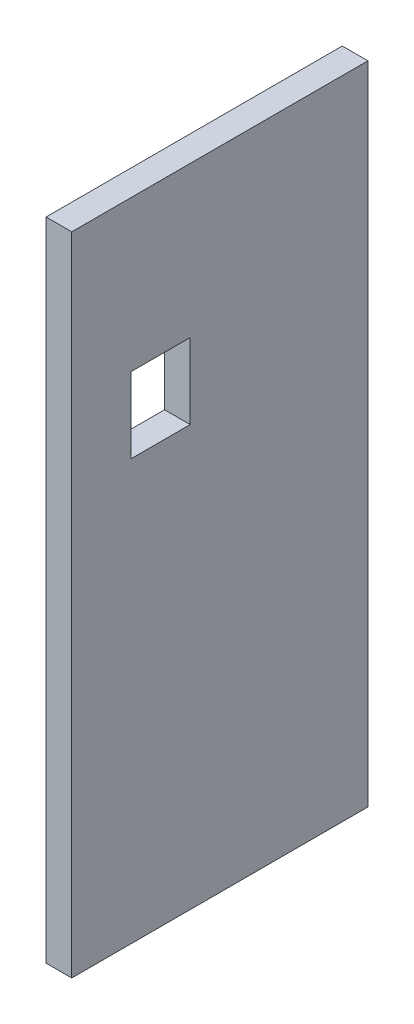
ISO-10303-21;
HEADER;
FILE_DESCRIPTION(('STEP AP214'),'2;1');
FILE_NAME('part.step','',(''),(''),'','','');
FILE_SCHEMA(('AUTOMOTIVE_DESIGN { 1 0 10303 214 1 1 1 1 }'));
ENDSEC;
DATA;
#1=APPLICATION_CONTEXT('core data for automotive mechanical design processes');
#2=APPLICATION_PROTOCOL_DEFINITION('international standard','automotive_design',2000,#1);
#3=PRODUCT_CONTEXT('',#1,'mechanical');
#4=PRODUCT('Part','Part','',(#3));
#5=PRODUCT_RELATED_PRODUCT_CATEGORY('part','',(#4));
#6=PRODUCT_DEFINITION_FORMATION('','',#4);
#7=PRODUCT_DEFINITION_CONTEXT('part definition',#1,'design');
#8=PRODUCT_DEFINITION('design','',#6,#7);
#9=PRODUCT_DEFINITION_SHAPE('','',#8);
#10=(LENGTH_UNIT() NAMED_UNIT(*) SI_UNIT(.MILLI.,.METRE.));
#11=(NAMED_UNIT(*) PLANE_ANGLE_UNIT() SI_UNIT($,.RADIAN.));
#12=(NAMED_UNIT(*) SI_UNIT($,.STERADIAN.) SOLID_ANGLE_UNIT());
#13=UNCERTAINTY_MEASURE_WITH_UNIT(LENGTH_MEASURE(1.E-05),#10,'distance_accuracy_value','');
#14=(GEOMETRIC_REPRESENTATION_CONTEXT(3) GLOBAL_UNCERTAINTY_ASSIGNED_CONTEXT((#13)) GLOBAL_UNIT_ASSIGNED_CONTEXT((#10,
#11,#12)) REPRESENTATION_CONTEXT('',''));
#15=CARTESIAN_POINT('',(0.,0.,0.));
#16=DIRECTION('',(0.,0.,1.));
#17=DIRECTION('',(1.,0.,0.));
#18=AXIS2_PLACEMENT_3D('',#15,#16,#17);
#19=CARTESIAN_POINT('',(4.7625,-60.,-27.5));
#20=DIRECTION('',(0.,0.,1.));
#21=DIRECTION('',(1.,0.,0.));
#22=AXIS2_PLACEMENT_3D('',#19,#20,#21);
#23=PLANE('',#22);
#24=DIRECTION('',(0.,1.,0.));
#25=VECTOR('',#24,1.);
#26=CARTESIAN_POINT('',(0.,-60.,-27.5));
#27=LINE('',#26,#25);
#28=CARTESIAN_POINT('',(0.,-60.,-27.5));
#29=VERTEX_POINT('',#28);
#30=CARTESIAN_POINT('',(0.,60.,-27.5));
#31=VERTEX_POINT('',#30);
#32=EDGE_CURVE('E127',#29,#31,#27,.T.);
#33=ORIENTED_EDGE('',*,*,#32,.T.);
#34=DIRECTION('',(-1.,0.,0.));
#35=VECTOR('',#34,1.);
#36=CARTESIAN_POINT('',(4.7625,60.,-27.5));
#37=LINE('',#36,#35);
#38=CARTESIAN_POINT('',(4.7625,60.,-27.5));
#39=VERTEX_POINT('',#38);
#40=EDGE_CURVE('E11',#39,#31,#37,.T.);
#41=ORIENTED_EDGE('',*,*,#40,.F.);
#42=DIRECTION('',(0.,1.,0.));
#43=VECTOR('',#42,1.);
#44=CARTESIAN_POINT('',(4.7625,-60.,-27.5));
#45=LINE('',#44,#43);
#46=CARTESIAN_POINT('',(4.7625,-60.,-27.5));
#47=VERTEX_POINT('',#46);
#48=EDGE_CURVE('E131',#47,#39,#45,.T.);
#49=ORIENTED_EDGE('',*,*,#48,.F.);
#50=DIRECTION('',(-1.,0.,0.));
#51=VECTOR('',#50,1.);
#52=CARTESIAN_POINT('',(4.7625,-60.,-27.5));
#53=LINE('',#52,#51);
#54=EDGE_CURVE('E141',#47,#29,#53,.T.);
#55=ORIENTED_EDGE('',*,*,#54,.T.);
#56=EDGE_LOOP('',(#33,#41,#49,#55));
#57=FACE_BOUND('',#56,.T.);
#58=ADVANCED_FACE('F32',(#57),#23,.F.);
#59=CARTESIAN_POINT('',(4.7625,60.,27.5));
#60=DIRECTION('',(0.,-1.,0.));
#61=DIRECTION('',(0.,0.,-1.));
#62=AXIS2_PLACEMENT_3D('',#59,#60,#61);
#63=PLANE('',#62);
#64=DIRECTION('',(0.,0.,1.));
#65=VECTOR('',#64,1.);
#66=CARTESIAN_POINT('',(0.,60.,27.5));
#67=LINE('',#66,#65);
#68=CARTESIAN_POINT('',(0.,60.,27.5));
#69=VERTEX_POINT('',#68);
#70=EDGE_CURVE('E144',#31,#69,#67,.T.);
#71=ORIENTED_EDGE('',*,*,#70,.T.);
#72=DIRECTION('',(-1.,0.,0.));
#73=VECTOR('',#72,1.);
#74=CARTESIAN_POINT('',(4.7625,60.,27.5));
#75=LINE('',#74,#73);
#76=CARTESIAN_POINT('',(4.7625,60.,27.5));
#77=VERTEX_POINT('',#76);
#78=EDGE_CURVE('E39',#77,#69,#75,.T.);
#79=ORIENTED_EDGE('',*,*,#78,.F.);
#80=DIRECTION('',(0.,0.,1.));
#81=VECTOR('',#80,1.);
#82=CARTESIAN_POINT('',(4.7625,60.,27.5));
#83=LINE('',#82,#81);
#84=EDGE_CURVE('E134',#39,#77,#83,.T.);
#85=ORIENTED_EDGE('',*,*,#84,.F.);
#86=ORIENTED_EDGE('',*,*,#40,.T.);
#87=EDGE_LOOP('',(#71,#79,#85,#86));
#88=FACE_BOUND('',#87,.T.);
#89=ADVANCED_FACE('F172',(#88),#63,.F.);
#90=CARTESIAN_POINT('',(4.7625,-60.,27.5));
#91=DIRECTION('',(0.,0.,-1.));
#92=DIRECTION('',(-1.,0.,0.));
#93=AXIS2_PLACEMENT_3D('',#90,#91,#92);
#94=PLANE('',#93);
#95=DIRECTION('',(0.,-1.,0.));
#96=VECTOR('',#95,1.);
#97=CARTESIAN_POINT('',(0.,-60.,27.5));
#98=LINE('',#97,#96);
#99=CARTESIAN_POINT('',(0.,-60.,27.5));
#100=VERTEX_POINT('',#99);
#101=EDGE_CURVE('E146',#69,#100,#98,.T.);
#102=ORIENTED_EDGE('',*,*,#101,.T.);
#103=DIRECTION('',(-1.,0.,0.));
#104=VECTOR('',#103,1.);
#105=CARTESIAN_POINT('',(4.7625,-60.,27.5));
#106=LINE('',#105,#104);
#107=CARTESIAN_POINT('',(4.7625,-60.,27.5));
#108=VERTEX_POINT('',#107);
#109=EDGE_CURVE('E151',#108,#100,#106,.T.);
#110=ORIENTED_EDGE('',*,*,#109,.F.);
#111=DIRECTION('',(0.,-1.,0.));
#112=VECTOR('',#111,1.);
#113=CARTESIAN_POINT('',(4.7625,-60.,27.5));
#114=LINE('',#113,#112);
#115=EDGE_CURVE('E137',#77,#108,#114,.T.);
#116=ORIENTED_EDGE('',*,*,#115,.F.);
#117=ORIENTED_EDGE('',*,*,#78,.T.);
#118=EDGE_LOOP('',(#102,#110,#116,#117));
#119=FACE_BOUND('',#118,.T.);
#120=ADVANCED_FACE('F158',(#119),#94,.F.);
#121=CARTESIAN_POINT('',(4.7625,-60.,27.5));
#122=DIRECTION('',(0.,1.,0.));
#123=DIRECTION('',(0.,0.,1.));
#124=AXIS2_PLACEMENT_3D('',#121,#122,#123);
#125=PLANE('',#124);
#126=DIRECTION('',(0.,0.,-1.));
#127=VECTOR('',#126,1.);
#128=CARTESIAN_POINT('',(0.,-60.,27.5));
#129=LINE('',#128,#127);
#130=EDGE_CURVE('E135',#100,#29,#129,.T.);
#131=ORIENTED_EDGE('',*,*,#130,.T.);
#132=ORIENTED_EDGE('',*,*,#54,.F.);
#133=DIRECTION('',(0.,0.,-1.));
#134=VECTOR('',#133,1.);
#135=CARTESIAN_POINT('',(4.7625,-60.,27.5));
#136=LINE('',#135,#134);
#137=EDGE_CURVE('E139',#108,#47,#136,.T.);
#138=ORIENTED_EDGE('',*,*,#137,.F.);
#139=ORIENTED_EDGE('',*,*,#109,.T.);
#140=EDGE_LOOP('',(#131,#132,#138,#139));
#141=FACE_BOUND('',#140,.T.);
#142=ADVANCED_FACE('F167',(#141),#125,.F.);
#143=CARTESIAN_POINT('',(4.7625,0.,0.));
#144=DIRECTION('',(-1.,0.,0.));
#145=DIRECTION('',(0.,0.,1.));
#146=AXIS2_PLACEMENT_3D('',#143,#144,#145);
#147=PLANE('',#146);
#148=DIRECTION('',(0.,0.,1.));
#149=VECTOR('',#148,1.);
#150=CARTESIAN_POINT('',(4.7625,32.,5.49999999999998));
#151=LINE('',#150,#149);
#152=CARTESIAN_POINT('',(4.7625,32.,5.49999999999998));
#153=VERTEX_POINT('',#152);
#154=CARTESIAN_POINT('',(4.7625,32.,16.5));
#155=VERTEX_POINT('',#154);
#156=EDGE_CURVE('E101',#153,#155,#151,.T.);
#157=ORIENTED_EDGE('',*,*,#156,.F.);
#158=DIRECTION('',(0.,-1.,0.));
#159=VECTOR('',#158,1.);
#160=CARTESIAN_POINT('',(4.7625,32.,5.49999999999998));
#161=LINE('',#160,#159);
#162=CARTESIAN_POINT('',(4.7625,18.,5.49999999999998));
#163=VERTEX_POINT('',#162);
#164=EDGE_CURVE('E98',#153,#163,#161,.T.);
#165=ORIENTED_EDGE('',*,*,#164,.T.);
#166=DIRECTION('',(0.,0.,1.));
#167=VECTOR('',#166,1.);
#168=CARTESIAN_POINT('',(4.7625,18.,5.49999999999998));
#169=LINE('',#168,#167);
#170=CARTESIAN_POINT('',(4.7625,18.,16.5));
#171=VERTEX_POINT('',#170);
#172=EDGE_CURVE('E104',#163,#171,#169,.T.);
#173=ORIENTED_EDGE('',*,*,#172,.T.);
#174=DIRECTION('',(0.,-1.,0.));
#175=VECTOR('',#174,1.);
#176=CARTESIAN_POINT('',(4.7625,32.,16.5));
#177=LINE('',#176,#175);
#178=EDGE_CURVE('E108',#155,#171,#177,.T.);
#179=ORIENTED_EDGE('',*,*,#178,.F.);
#180=EDGE_LOOP('',(#157,#165,#173,#179));
#181=FACE_BOUND('',#180,.T.);
#182=ORIENTED_EDGE('',*,*,#48,.T.);
#183=ORIENTED_EDGE('',*,*,#84,.T.);
#184=ORIENTED_EDGE('',*,*,#115,.T.);
#185=ORIENTED_EDGE('',*,*,#137,.T.);
#186=EDGE_LOOP('',(#182,#183,#184,#185));
#187=FACE_BOUND('',#186,.T.);
#188=ADVANCED_FACE('F110',(#181,#187),#147,.F.);
#189=CARTESIAN_POINT('',(0.,0.,0.));
#190=DIRECTION('',(-1.,0.,0.));
#191=DIRECTION('',(0.,0.,1.));
#192=AXIS2_PLACEMENT_3D('',#189,#190,#191);
#193=PLANE('',#192);
#194=DIRECTION('',(0.,-1.,0.));
#195=VECTOR('',#194,1.);
#196=CARTESIAN_POINT('',(0.,32.,5.49999999999998));
#197=LINE('',#196,#195);
#198=CARTESIAN_POINT('',(0.,32.,5.49999999999998));
#199=VERTEX_POINT('',#198);
#200=CARTESIAN_POINT('',(0.,18.,5.49999999999998));
#201=VERTEX_POINT('',#200);
#202=EDGE_CURVE('E54',#199,#201,#197,.T.);
#203=ORIENTED_EDGE('',*,*,#202,.F.);
#204=DIRECTION('',(0.,0.,1.));
#205=VECTOR('',#204,1.);
#206=CARTESIAN_POINT('',(0.,32.,5.49999999999998));
#207=LINE('',#206,#205);
#208=CARTESIAN_POINT('',(0.,32.,16.5));
#209=VERTEX_POINT('',#208);
#210=EDGE_CURVE('E112',#199,#209,#207,.T.);
#211=ORIENTED_EDGE('',*,*,#210,.T.);
#212=DIRECTION('',(0.,-1.,0.));
#213=VECTOR('',#212,1.);
#214=CARTESIAN_POINT('',(0.,32.,16.5));
#215=LINE('',#214,#213);
#216=CARTESIAN_POINT('',(0.,18.,16.5));
#217=VERTEX_POINT('',#216);
#218=EDGE_CURVE('E115',#209,#217,#215,.T.);
#219=ORIENTED_EDGE('',*,*,#218,.T.);
#220=DIRECTION('',(0.,0.,1.));
#221=VECTOR('',#220,1.);
#222=CARTESIAN_POINT('',(0.,18.,5.49999999999998));
#223=LINE('',#222,#221);
#224=EDGE_CURVE('E121',#201,#217,#223,.T.);
#225=ORIENTED_EDGE('',*,*,#224,.F.);
#226=EDGE_LOOP('',(#203,#211,#219,#225));
#227=FACE_BOUND('',#226,.T.);
#228=ORIENTED_EDGE('',*,*,#32,.F.);
#229=ORIENTED_EDGE('',*,*,#130,.F.);
#230=ORIENTED_EDGE('',*,*,#101,.F.);
#231=ORIENTED_EDGE('',*,*,#70,.F.);
#232=EDGE_LOOP('',(#228,#229,#230,#231));
#233=FACE_BOUND('',#232,.T.);
#234=ADVANCED_FACE('F164',(#227,#233),#193,.T.);
#235=CARTESIAN_POINT('',(4.7625,32.,5.49999999999998));
#236=DIRECTION('',(0.,0.,-1.));
#237=DIRECTION('',(0.,1.,0.));
#238=AXIS2_PLACEMENT_3D('',#235,#236,#237);
#239=PLANE('',#238);
#240=ORIENTED_EDGE('',*,*,#202,.T.);
#241=DIRECTION('',(-1.,0.,0.));
#242=VECTOR('',#241,1.);
#243=CARTESIAN_POINT('',(4.7625,18.,5.49999999999998));
#244=LINE('',#243,#242);
#245=EDGE_CURVE('E95',#163,#201,#244,.T.);
#246=ORIENTED_EDGE('',*,*,#245,.F.);
#247=ORIENTED_EDGE('',*,*,#164,.F.);
#248=DIRECTION('',(-1.,0.,0.));
#249=VECTOR('',#248,1.);
#250=CARTESIAN_POINT('',(4.7625,32.,5.49999999999998));
#251=LINE('',#250,#249);
#252=EDGE_CURVE('E125',#153,#199,#251,.T.);
#253=ORIENTED_EDGE('',*,*,#252,.T.);
#254=EDGE_LOOP('',(#240,#246,#247,#253));
#255=FACE_BOUND('',#254,.T.);
#256=ADVANCED_FACE('F96',(#255),#239,.F.);
#257=CARTESIAN_POINT('',(4.7625,32.,5.49999999999998));
#258=DIRECTION('',(0.,-1.,0.));
#259=DIRECTION('',(0.,0.,-1.));
#260=AXIS2_PLACEMENT_3D('',#257,#258,#259);
#261=PLANE('',#260);
#262=ORIENTED_EDGE('',*,*,#210,.F.);
#263=ORIENTED_EDGE('',*,*,#252,.F.);
#264=ORIENTED_EDGE('',*,*,#156,.T.);
#265=DIRECTION('',(-1.,0.,0.));
#266=VECTOR('',#265,1.);
#267=CARTESIAN_POINT('',(4.7625,32.,16.5));
#268=LINE('',#267,#266);
#269=EDGE_CURVE('E128',#155,#209,#268,.T.);
#270=ORIENTED_EDGE('',*,*,#269,.T.);
#271=EDGE_LOOP('',(#262,#263,#264,#270));
#272=FACE_BOUND('',#271,.T.);
#273=ADVANCED_FACE('F189',(#272),#261,.T.);
#274=CARTESIAN_POINT('',(4.7625,32.,16.5));
#275=DIRECTION('',(0.,0.,-1.));
#276=DIRECTION('',(-1.,0.,0.));
#277=AXIS2_PLACEMENT_3D('',#274,#275,#276);
#278=PLANE('',#277);
#279=ORIENTED_EDGE('',*,*,#218,.F.);
#280=ORIENTED_EDGE('',*,*,#269,.F.);
#281=ORIENTED_EDGE('',*,*,#178,.T.);
#282=DIRECTION('',(-1.,0.,0.));
#283=VECTOR('',#282,1.);
#284=CARTESIAN_POINT('',(4.7625,18.,16.5));
#285=LINE('',#284,#283);
#286=EDGE_CURVE('E46',#171,#217,#285,.T.);
#287=ORIENTED_EDGE('',*,*,#286,.T.);
#288=EDGE_LOOP('',(#279,#280,#281,#287));
#289=FACE_BOUND('',#288,.T.);
#290=ADVANCED_FACE('F192',(#289),#278,.T.);
#291=CARTESIAN_POINT('',(4.7625,18.,5.49999999999998));
#292=DIRECTION('',(0.,-1.,0.));
#293=DIRECTION('',(0.,0.,-1.));
#294=AXIS2_PLACEMENT_3D('',#291,#292,#293);
#295=PLANE('',#294);
#296=ORIENTED_EDGE('',*,*,#224,.T.);
#297=ORIENTED_EDGE('',*,*,#286,.F.);
#298=ORIENTED_EDGE('',*,*,#172,.F.);
#299=ORIENTED_EDGE('',*,*,#245,.T.);
#300=EDGE_LOOP('',(#296,#297,#298,#299));
#301=FACE_BOUND('',#300,.T.);
#302=ADVANCED_FACE('F105',(#301),#295,.F.);
#303=CLOSED_SHELL('',(#58,#89,#120,#142,#188,#234,#256,#273,#290,#302));
#304=MANIFOLD_SOLID_BREP('B2',#303);
#305=ADVANCED_BREP_SHAPE_REPRESENTATION('',(#18,#304),#14);
#306=SHAPE_DEFINITION_REPRESENTATION(#9,#305);
ENDSEC;
END-ISO-10303-21;
